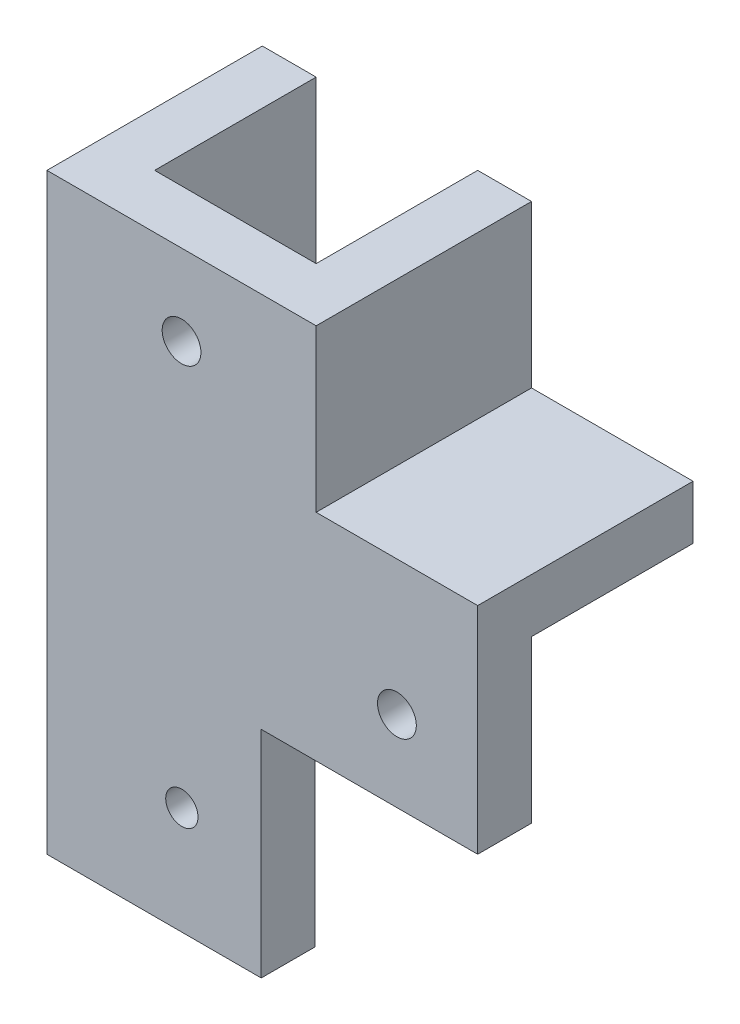
ISO-10303-21;
HEADER;
FILE_DESCRIPTION(('STEP AP214'),'2;1');
FILE_NAME('part.step','',(''),(''),'','','');
FILE_SCHEMA(('AUTOMOTIVE_DESIGN { 1 0 10303 214 1 1 1 1 }'));
ENDSEC;
DATA;
#1=APPLICATION_CONTEXT('core data for automotive mechanical design processes');
#2=APPLICATION_PROTOCOL_DEFINITION('international standard','automotive_design',2000,#1);
#3=PRODUCT_CONTEXT('',#1,'mechanical');
#4=PRODUCT('Part','Part','',(#3));
#5=PRODUCT_RELATED_PRODUCT_CATEGORY('part','',(#4));
#6=PRODUCT_DEFINITION_FORMATION('','',#4);
#7=PRODUCT_DEFINITION_CONTEXT('part definition',#1,'design');
#8=PRODUCT_DEFINITION('design','',#6,#7);
#9=PRODUCT_DEFINITION_SHAPE('','',#8);
#10=(LENGTH_UNIT() NAMED_UNIT(*) SI_UNIT(.MILLI.,.METRE.));
#11=(NAMED_UNIT(*) PLANE_ANGLE_UNIT() SI_UNIT($,.RADIAN.));
#12=(NAMED_UNIT(*) SI_UNIT($,.STERADIAN.) SOLID_ANGLE_UNIT());
#13=UNCERTAINTY_MEASURE_WITH_UNIT(LENGTH_MEASURE(1.E-05),#10,'distance_accuracy_value','');
#14=(GEOMETRIC_REPRESENTATION_CONTEXT(3) GLOBAL_UNCERTAINTY_ASSIGNED_CONTEXT((#13)) GLOBAL_UNIT_ASSIGNED_CONTEXT((#10,
#11,#12)) REPRESENTATION_CONTEXT('',''));
#15=CARTESIAN_POINT('',(0.,0.,0.));
#16=DIRECTION('',(0.,0.,1.));
#17=DIRECTION('',(1.,0.,0.));
#18=AXIS2_PLACEMENT_3D('',#15,#16,#17);
#19=CARTESIAN_POINT('',(7.47011952191236,-10.8067729083665,-15.));
#20=DIRECTION('',(1.,0.,0.));
#21=DIRECTION('',(0.,1.,0.));
#22=AXIS2_PLACEMENT_3D('',#19,#20,#21);
#23=PLANE('',#22);
#24=DIRECTION('',(0.,1.,0.));
#25=VECTOR('',#24,1.);
#26=CARTESIAN_POINT('',(7.47011952191236,9.19322709163348,0.));
#27=LINE('',#26,#25);
#28=CARTESIAN_POINT('',(7.47011952191236,-10.8067729083665,0.));
#29=VERTEX_POINT('',#28);
#30=CARTESIAN_POINT('',(7.47011952191236,9.19322709163348,0.));
#31=VERTEX_POINT('',#30);
#32=EDGE_CURVE('E208',#29,#31,#27,.T.);
#33=ORIENTED_EDGE('',*,*,#32,.T.);
#34=DIRECTION('',(0.,0.,1.));
#35=VECTOR('',#34,1.);
#36=CARTESIAN_POINT('',(7.47011952191236,9.19322709163348,-15.));
#37=LINE('',#36,#35);
#38=CARTESIAN_POINT('',(7.47011952191236,9.19322709163348,-15.));
#39=VERTEX_POINT('',#38);
#40=EDGE_CURVE('E11',#39,#31,#37,.T.);
#41=ORIENTED_EDGE('',*,*,#40,.F.);
#42=DIRECTION('',(0.,1.,0.));
#43=VECTOR('',#42,1.);
#44=CARTESIAN_POINT('',(7.47011952191236,-10.8067729083665,-15.));
#45=LINE('',#44,#43);
#46=CARTESIAN_POINT('',(7.47011952191236,-10.8067729083665,-15.));
#47=VERTEX_POINT('',#46);
#48=EDGE_CURVE('E268',#47,#39,#45,.T.);
#49=ORIENTED_EDGE('',*,*,#48,.F.);
#50=DIRECTION('',(0.,0.,1.));
#51=VECTOR('',#50,1.);
#52=CARTESIAN_POINT('',(7.47011952191236,-10.8067729083665,-15.));
#53=LINE('',#52,#51);
#54=EDGE_CURVE('E284',#47,#29,#53,.T.);
#55=ORIENTED_EDGE('',*,*,#54,.T.);
#56=EDGE_LOOP('',(#33,#41,#49,#55));
#57=FACE_BOUND('',#56,.T.);
#58=ADVANCED_FACE('F41',(#57),#23,.F.);
#59=CARTESIAN_POINT('',(27.4701195219124,-10.8067729083665,-15.));
#60=DIRECTION('',(0.,1.,0.));
#61=DIRECTION('',(-1.,0.,0.));
#62=AXIS2_PLACEMENT_3D('',#59,#60,#61);
#63=PLANE('',#62);
#64=DIRECTION('',(-1.,0.,0.));
#65=VECTOR('',#64,1.);
#66=CARTESIAN_POINT('',(27.4701195219124,-10.8067729083665,0.));
#67=LINE('',#66,#65);
#68=CARTESIAN_POINT('',(27.4701195219124,-10.8067729083665,0.));
#69=VERTEX_POINT('',#68);
#70=EDGE_CURVE('E204',#69,#29,#67,.T.);
#71=ORIENTED_EDGE('',*,*,#70,.T.);
#72=ORIENTED_EDGE('',*,*,#54,.F.);
#73=DIRECTION('',(-1.,0.,0.));
#74=VECTOR('',#73,1.);
#75=CARTESIAN_POINT('',(27.4701195219124,-10.8067729083665,-15.));
#76=LINE('',#75,#74);
#77=CARTESIAN_POINT('',(27.4701195219124,-10.8067729083665,-15.));
#78=VERTEX_POINT('',#77);
#79=EDGE_CURVE('E56',#78,#47,#76,.T.);
#80=ORIENTED_EDGE('',*,*,#79,.F.);
#81=DIRECTION('',(0.,0.,1.));
#82=VECTOR('',#81,1.);
#83=CARTESIAN_POINT('',(27.4701195219124,-10.8067729083665,-15.));
#84=LINE('',#83,#82);
#85=EDGE_CURVE('E288',#78,#69,#84,.T.);
#86=ORIENTED_EDGE('',*,*,#85,.T.);
#87=EDGE_LOOP('',(#71,#72,#80,#86));
#88=FACE_BOUND('',#87,.T.);
#89=ADVANCED_FACE('F342',(#88),#63,.F.);
#90=CARTESIAN_POINT('',(7.47011952191236,9.19322709163348,-15.));
#91=DIRECTION('',(0.,-1.,0.));
#92=DIRECTION('',(0.,0.,-1.));
#93=AXIS2_PLACEMENT_3D('',#90,#91,#92);
#94=PLANE('',#93);
#95=ORIENTED_EDGE('',*,*,#40,.T.);
#96=DIRECTION('',(-1.,0.,0.));
#97=VECTOR('',#96,1.);
#98=CARTESIAN_POINT('',(-7.52988047808764,9.19322709163348,0.));
#99=LINE('',#98,#97);
#100=CARTESIAN_POINT('',(-7.52988047808764,9.19322709163348,0.));
#101=VERTEX_POINT('',#100);
#102=EDGE_CURVE('E196',#31,#101,#99,.T.);
#103=ORIENTED_EDGE('',*,*,#102,.T.);
#104=DIRECTION('',(0.,0.,1.));
#105=VECTOR('',#104,1.);
#106=CARTESIAN_POINT('',(-7.52988047808764,9.19322709163348,-15.));
#107=LINE('',#106,#105);
#108=CARTESIAN_POINT('',(-7.52988047808764,9.19322709163348,-15.));
#109=VERTEX_POINT('',#108);
#110=EDGE_CURVE('E240',#109,#101,#107,.T.);
#111=ORIENTED_EDGE('',*,*,#110,.F.);
#112=DIRECTION('',(1.,0.,0.));
#113=VECTOR('',#112,1.);
#114=CARTESIAN_POINT('',(-7.52988047808764,9.19322709163348,-15.));
#115=LINE('',#114,#113);
#116=CARTESIAN_POINT('',(-12.5298804780876,9.19322709163348,-15.));
#117=VERTEX_POINT('',#116);
#118=EDGE_CURVE('E237',#117,#109,#115,.T.);
#119=ORIENTED_EDGE('',*,*,#118,.F.);
#120=DIRECTION('',(0.,0.,1.));
#121=VECTOR('',#120,1.);
#122=CARTESIAN_POINT('',(-12.5298804780876,9.19322709163348,-15.));
#123=LINE('',#122,#121);
#124=CARTESIAN_POINT('',(-12.5298804780876,9.19322709163348,5.));
#125=VERTEX_POINT('',#124);
#126=EDGE_CURVE('E244',#117,#125,#123,.T.);
#127=ORIENTED_EDGE('',*,*,#126,.T.);
#128=DIRECTION('',(-1.,0.,0.));
#129=VECTOR('',#128,1.);
#130=CARTESIAN_POINT('',(7.47011952191236,9.19322709163348,5.));
#131=LINE('',#130,#129);
#132=CARTESIAN_POINT('',(12.4701195219124,9.19322709163348,5.));
#133=VERTEX_POINT('',#132);
#134=EDGE_CURVE('E265',#133,#125,#131,.T.);
#135=ORIENTED_EDGE('',*,*,#134,.F.);
#136=DIRECTION('',(0.,0.,1.));
#137=VECTOR('',#136,1.);
#138=CARTESIAN_POINT('',(12.4701195219124,9.19322709163348,-15.));
#139=LINE('',#138,#137);
#140=CARTESIAN_POINT('',(12.4701195219124,9.19322709163348,-15.));
#141=VERTEX_POINT('',#140);
#142=EDGE_CURVE('E49',#141,#133,#139,.T.);
#143=ORIENTED_EDGE('',*,*,#142,.F.);
#144=DIRECTION('',(1.,0.,0.));
#145=VECTOR('',#144,1.);
#146=CARTESIAN_POINT('',(7.47011952191236,9.19322709163348,-15.));
#147=LINE('',#146,#145);
#148=EDGE_CURVE('E271',#39,#141,#147,.T.);
#149=ORIENTED_EDGE('',*,*,#148,.F.);
#150=EDGE_LOOP('',(#95,#103,#111,#119,#127,#135,#143,#149));
#151=FACE_BOUND('',#150,.T.);
#152=ADVANCED_FACE('F310',(#151),#94,.F.);
#153=CARTESIAN_POINT('',(12.4701195219124,9.19322709163348,-15.));
#154=DIRECTION('',(-1.,0.,0.));
#155=DIRECTION('',(0.,-1.,0.));
#156=AXIS2_PLACEMENT_3D('',#153,#154,#155);
#157=PLANE('',#156);
#158=ORIENTED_EDGE('',*,*,#142,.T.);
#159=DIRECTION('',(0.,1.,0.));
#160=VECTOR('',#159,1.);
#161=CARTESIAN_POINT('',(12.4701195219124,9.19322709163348,5.));
#162=LINE('',#161,#160);
#163=CARTESIAN_POINT('',(12.4701195219124,-5.80677290836653,5.));
#164=VERTEX_POINT('',#163);
#165=EDGE_CURVE('E261',#164,#133,#162,.T.);
#166=ORIENTED_EDGE('',*,*,#165,.F.);
#167=DIRECTION('',(0.,0.,1.));
#168=VECTOR('',#167,1.);
#169=CARTESIAN_POINT('',(12.4701195219124,-5.80677290836653,-15.));
#170=LINE('',#169,#168);
#171=CARTESIAN_POINT('',(12.4701195219124,-5.80677290836653,-15.));
#172=VERTEX_POINT('',#171);
#173=EDGE_CURVE('E295',#172,#164,#170,.T.);
#174=ORIENTED_EDGE('',*,*,#173,.F.);
#175=DIRECTION('',(0.,-1.,0.));
#176=VECTOR('',#175,1.);
#177=CARTESIAN_POINT('',(12.4701195219124,9.19322709163348,-15.));
#178=LINE('',#177,#176);
#179=EDGE_CURVE('E274',#141,#172,#178,.T.);
#180=ORIENTED_EDGE('',*,*,#179,.F.);
#181=EDGE_LOOP('',(#158,#166,#174,#180));
#182=FACE_BOUND('',#181,.T.);
#183=ADVANCED_FACE('F302',(#182),#157,.F.);
#184=CARTESIAN_POINT('',(12.4701195219124,-5.80677290836653,-15.));
#185=DIRECTION('',(0.,-1.,0.));
#186=DIRECTION('',(1.,0.,0.));
#187=AXIS2_PLACEMENT_3D('',#184,#185,#186);
#188=PLANE('',#187);
#189=ORIENTED_EDGE('',*,*,#173,.T.);
#190=DIRECTION('',(-1.,0.,0.));
#191=VECTOR('',#190,1.);
#192=CARTESIAN_POINT('',(12.4701195219124,-5.80677290836653,5.));
#193=LINE('',#192,#191);
#194=CARTESIAN_POINT('',(27.4701195219124,-5.80677290836653,5.));
#195=VERTEX_POINT('',#194);
#196=EDGE_CURVE('E257',#195,#164,#193,.T.);
#197=ORIENTED_EDGE('',*,*,#196,.F.);
#198=DIRECTION('',(0.,0.,1.));
#199=VECTOR('',#198,1.);
#200=CARTESIAN_POINT('',(27.4701195219124,-5.80677290836653,-15.));
#201=LINE('',#200,#199);
#202=CARTESIAN_POINT('',(27.4701195219124,-5.80677290836653,-15.));
#203=VERTEX_POINT('',#202);
#204=EDGE_CURVE('E292',#203,#195,#201,.T.);
#205=ORIENTED_EDGE('',*,*,#204,.F.);
#206=DIRECTION('',(1.,0.,0.));
#207=VECTOR('',#206,1.);
#208=CARTESIAN_POINT('',(12.4701195219124,-5.80677290836653,-15.));
#209=LINE('',#208,#207);
#210=EDGE_CURVE('E277',#172,#203,#209,.T.);
#211=ORIENTED_EDGE('',*,*,#210,.F.);
#212=EDGE_LOOP('',(#189,#197,#205,#211));
#213=FACE_BOUND('',#212,.T.);
#214=ADVANCED_FACE('F337',(#213),#188,.F.);
#215=CARTESIAN_POINT('',(27.4701195219124,-10.8067729083665,-15.));
#216=DIRECTION('',(-1.,0.,0.));
#217=DIRECTION('',(0.,0.,1.));
#218=AXIS2_PLACEMENT_3D('',#215,#216,#217);
#219=PLANE('',#218);
#220=ORIENTED_EDGE('',*,*,#204,.T.);
#221=DIRECTION('',(0.,1.,0.));
#222=VECTOR('',#221,1.);
#223=CARTESIAN_POINT('',(27.4701195219124,-5.80677290836653,5.));
#224=LINE('',#223,#222);
#225=CARTESIAN_POINT('',(27.4701195219124,-25.8067729083665,5.));
#226=VERTEX_POINT('',#225);
#227=EDGE_CURVE('E253',#226,#195,#224,.T.);
#228=ORIENTED_EDGE('',*,*,#227,.F.);
#229=DIRECTION('',(0.,0.,-1.));
#230=VECTOR('',#229,1.);
#231=CARTESIAN_POINT('',(27.4701195219124,-25.8067729083665,5.));
#232=LINE('',#231,#230);
#233=CARTESIAN_POINT('',(27.4701195219124,-25.8067729083665,0.));
#234=VERTEX_POINT('',#233);
#235=EDGE_CURVE('E195',#226,#234,#232,.T.);
#236=ORIENTED_EDGE('',*,*,#235,.T.);
#237=DIRECTION('',(0.,1.,0.));
#238=VECTOR('',#237,1.);
#239=CARTESIAN_POINT('',(27.4701195219124,-25.8067729083665,0.));
#240=LINE('',#239,#238);
#241=EDGE_CURVE('E201',#234,#69,#240,.T.);
#242=ORIENTED_EDGE('',*,*,#241,.T.);
#243=ORIENTED_EDGE('',*,*,#85,.F.);
#244=DIRECTION('',(0.,-1.,0.));
#245=VECTOR('',#244,1.);
#246=CARTESIAN_POINT('',(27.4701195219124,-10.8067729083665,-15.));
#247=LINE('',#246,#245);
#248=EDGE_CURVE('E61',#203,#78,#247,.T.);
#249=ORIENTED_EDGE('',*,*,#248,.F.);
#250=EDGE_LOOP('',(#220,#228,#236,#242,#243,#249));
#251=FACE_BOUND('',#250,.T.);
#252=ADVANCED_FACE('F330',(#251),#219,.F.);
#253=CARTESIAN_POINT('',(0.,0.,-15.));
#254=DIRECTION('',(0.,0.,-1.));
#255=DIRECTION('',(-1.,0.,0.));
#256=AXIS2_PLACEMENT_3D('',#253,#254,#255);
#257=PLANE('',#256);
#258=ORIENTED_EDGE('',*,*,#48,.T.);
#259=ORIENTED_EDGE('',*,*,#148,.T.);
#260=ORIENTED_EDGE('',*,*,#179,.T.);
#261=ORIENTED_EDGE('',*,*,#210,.T.);
#262=ORIENTED_EDGE('',*,*,#248,.T.);
#263=ORIENTED_EDGE('',*,*,#79,.T.);
#264=EDGE_LOOP('',(#258,#259,#260,#261,#262,#263));
#265=FACE_BOUND('',#264,.T.);
#266=ADVANCED_FACE('F328',(#265),#257,.T.);
#267=CARTESIAN_POINT('',(0.,0.,5.));
#268=DIRECTION('',(0.,0.,-1.));
#269=DIRECTION('',(-1.,0.,0.));
#270=AXIS2_PLACEMENT_3D('',#267,#268,#269);
#271=PLANE('',#270);
#272=DIRECTION('',(1.,0.,0.));
#273=VECTOR('',#272,1.);
#274=CARTESIAN_POINT('',(-7.52988047808764,-25.8067729083665,5.));
#275=LINE('',#274,#273);
#276=CARTESIAN_POINT('',(7.37011952191236,-25.8067729083665,5.));
#277=VERTEX_POINT('',#276);
#278=EDGE_CURVE('E191',#277,#226,#275,.T.);
#279=ORIENTED_EDGE('',*,*,#278,.T.);
#280=ORIENTED_EDGE('',*,*,#227,.T.);
#281=ORIENTED_EDGE('',*,*,#196,.T.);
#282=ORIENTED_EDGE('',*,*,#165,.T.);
#283=ORIENTED_EDGE('',*,*,#134,.T.);
#284=DIRECTION('',(0.,-1.,0.));
#285=VECTOR('',#284,1.);
#286=CARTESIAN_POINT('',(-12.5298804780876,9.19322709163348,5.));
#287=LINE('',#286,#285);
#288=CARTESIAN_POINT('',(-12.5298804780876,-45.8067729083665,5.));
#289=VERTEX_POINT('',#288);
#290=EDGE_CURVE('E217',#125,#289,#287,.T.);
#291=ORIENTED_EDGE('',*,*,#290,.T.);
#292=DIRECTION('',(1.,0.,0.));
#293=VECTOR('',#292,1.);
#294=CARTESIAN_POINT('',(-12.5298804780876,-45.8067729083665,5.));
#295=LINE('',#294,#293);
#296=CARTESIAN_POINT('',(7.37011952191236,-45.8067729083665,5.));
#297=VERTEX_POINT('',#296);
#298=EDGE_CURVE('E225',#289,#297,#295,.T.);
#299=ORIENTED_EDGE('',*,*,#298,.T.);
#300=DIRECTION('',(0.,1.,0.));
#301=VECTOR('',#300,1.);
#302=CARTESIAN_POINT('',(7.37011952191236,-45.8067729083665,5.));
#303=LINE('',#302,#301);
#304=EDGE_CURVE('E144',#297,#277,#303,.T.);
#305=ORIENTED_EDGE('',*,*,#304,.T.);
#306=EDGE_LOOP('',(#279,#280,#281,#282,#283,#291,#299,#305));
#307=FACE_BOUND('',#306,.T.);
#308=CARTESIAN_POINT('',(0.,-35.8067729083665,5.));
#309=DIRECTION('',(0.,0.,1.));
#310=DIRECTION('',(1.,0.,0.));
#311=AXIS2_PLACEMENT_3D('',#308,#309,#310);
#312=CIRCLE('',#311,1.5);
#313=CARTESIAN_POINT('',(1.5,-35.8067729083665,5.));
#314=VERTEX_POINT('',#313);
#315=EDGE_CURVE('E221',#314,#314,#312,.T.);
#316=ORIENTED_EDGE('',*,*,#315,.F.);
#317=EDGE_LOOP('',(#316));
#318=FACE_BOUND('',#317,.T.);
#319=CARTESIAN_POINT('',(-0.0298804780876419,1.69322709163348,5.));
#320=DIRECTION('',(0.,0.,-1.));
#321=DIRECTION('',(-1.,0.,0.));
#322=AXIS2_PLACEMENT_3D('',#319,#320,#321);
#323=CIRCLE('',#322,1.8);
#324=CARTESIAN_POINT('',(-1.82988047808764,1.69322709163348,5.));
#325=VERTEX_POINT('',#324);
#326=EDGE_CURVE('E175',#325,#325,#323,.T.);
#327=ORIENTED_EDGE('',*,*,#326,.T.);
#328=EDGE_LOOP('',(#327));
#329=FACE_BOUND('',#328,.T.);
#330=CARTESIAN_POINT('',(19.9701195219124,-18.3067729083665,5.));
#331=DIRECTION('',(0.,0.,-1.));
#332=DIRECTION('',(-1.,0.,0.));
#333=AXIS2_PLACEMENT_3D('',#330,#331,#332);
#334=CIRCLE('',#333,1.8);
#335=CARTESIAN_POINT('',(18.1701195219124,-18.3067729083665,5.));
#336=VERTEX_POINT('',#335);
#337=EDGE_CURVE('E184',#336,#336,#334,.T.);
#338=ORIENTED_EDGE('',*,*,#337,.T.);
#339=EDGE_LOOP('',(#338));
#340=FACE_BOUND('',#339,.T.);
#341=ADVANCED_FACE('F307',(#307,#318,#329,#340),#271,.F.);
#342=CARTESIAN_POINT('',(-7.52988047808764,-25.8067729083665,-15.));
#343=DIRECTION('',(-1.,0.,0.));
#344=DIRECTION('',(0.,-1.,0.));
#345=AXIS2_PLACEMENT_3D('',#342,#343,#344);
#346=PLANE('',#345);
#347=ORIENTED_EDGE('',*,*,#110,.T.);
#348=DIRECTION('',(0.,-1.,0.));
#349=VECTOR('',#348,1.);
#350=CARTESIAN_POINT('',(-7.52988047808764,9.19322709163348,0.));
#351=LINE('',#350,#349);
#352=CARTESIAN_POINT('',(-7.52988047808765,-45.8067729083665,0.));
#353=VERTEX_POINT('',#352);
#354=EDGE_CURVE('E179',#101,#353,#351,.T.);
#355=ORIENTED_EDGE('',*,*,#354,.T.);
#356=DIRECTION('',(0.,0.,1.));
#357=VECTOR('',#356,1.);
#358=CARTESIAN_POINT('',(-7.52988047808765,-45.8067729083665,-15.));
#359=LINE('',#358,#357);
#360=CARTESIAN_POINT('',(-7.52988047808765,-45.8067729083665,-15.));
#361=VERTEX_POINT('',#360);
#362=EDGE_CURVE('E155',#361,#353,#359,.T.);
#363=ORIENTED_EDGE('',*,*,#362,.F.);
#364=DIRECTION('',(0.,-1.,0.));
#365=VECTOR('',#364,1.);
#366=CARTESIAN_POINT('',(-7.52988047808764,-25.8067729083665,-15.));
#367=LINE('',#366,#365);
#368=EDGE_CURVE('E228',#109,#361,#367,.T.);
#369=ORIENTED_EDGE('',*,*,#368,.F.);
#370=EDGE_LOOP('',(#347,#355,#363,#369));
#371=FACE_BOUND('',#370,.T.);
#372=ADVANCED_FACE('F323',(#371),#346,.F.);
#373=CARTESIAN_POINT('',(-7.52988047808765,-45.8067729083665,-15.));
#374=DIRECTION('',(0.,1.,0.));
#375=DIRECTION('',(0.,0.,1.));
#376=AXIS2_PLACEMENT_3D('',#373,#374,#375);
#377=PLANE('',#376);
#378=ORIENTED_EDGE('',*,*,#362,.T.);
#379=DIRECTION('',(1.,0.,0.));
#380=VECTOR('',#379,1.);
#381=CARTESIAN_POINT('',(-7.52988047808764,-45.8067729083665,0.));
#382=LINE('',#381,#380);
#383=CARTESIAN_POINT('',(7.37011952191236,-45.8067729083665,0.));
#384=VERTEX_POINT('',#383);
#385=EDGE_CURVE('E151',#353,#384,#382,.T.);
#386=ORIENTED_EDGE('',*,*,#385,.T.);
#387=DIRECTION('',(0.,0.,1.));
#388=VECTOR('',#387,1.);
#389=CARTESIAN_POINT('',(7.37011952191236,-45.8067729083665,0.));
#390=LINE('',#389,#388);
#391=EDGE_CURVE('E137',#384,#297,#390,.T.);
#392=ORIENTED_EDGE('',*,*,#391,.T.);
#393=ORIENTED_EDGE('',*,*,#298,.F.);
#394=DIRECTION('',(0.,0.,1.));
#395=VECTOR('',#394,1.);
#396=CARTESIAN_POINT('',(-12.5298804780876,-45.8067729083665,-15.));
#397=LINE('',#396,#395);
#398=CARTESIAN_POINT('',(-12.5298804780876,-45.8067729083665,-15.));
#399=VERTEX_POINT('',#398);
#400=EDGE_CURVE('E248',#399,#289,#397,.T.);
#401=ORIENTED_EDGE('',*,*,#400,.F.);
#402=DIRECTION('',(-1.,0.,0.));
#403=VECTOR('',#402,1.);
#404=CARTESIAN_POINT('',(-7.52988047808765,-45.8067729083665,-15.));
#405=LINE('',#404,#403);
#406=EDGE_CURVE('E231',#361,#399,#405,.T.);
#407=ORIENTED_EDGE('',*,*,#406,.F.);
#408=EDGE_LOOP('',(#378,#386,#392,#393,#401,#407));
#409=FACE_BOUND('',#408,.T.);
#410=ADVANCED_FACE('F152',(#409),#377,.F.);
#411=CARTESIAN_POINT('',(-12.5298804780876,-45.8067729083665,-15.));
#412=DIRECTION('',(1.,0.,0.));
#413=DIRECTION('',(0.,0.,-1.));
#414=AXIS2_PLACEMENT_3D('',#411,#412,#413);
#415=PLANE('',#414);
#416=ORIENTED_EDGE('',*,*,#400,.T.);
#417=ORIENTED_EDGE('',*,*,#290,.F.);
#418=ORIENTED_EDGE('',*,*,#126,.F.);
#419=DIRECTION('',(0.,1.,0.));
#420=VECTOR('',#419,1.);
#421=CARTESIAN_POINT('',(-12.5298804780876,-45.8067729083665,-15.));
#422=LINE('',#421,#420);
#423=EDGE_CURVE('E234',#399,#117,#422,.T.);
#424=ORIENTED_EDGE('',*,*,#423,.F.);
#425=EDGE_LOOP('',(#416,#417,#418,#424));
#426=FACE_BOUND('',#425,.T.);
#427=ADVANCED_FACE('F317',(#426),#415,.F.);
#428=CARTESIAN_POINT('',(0.,0.,-15.));
#429=DIRECTION('',(0.,0.,1.));
#430=DIRECTION('',(1.,0.,0.));
#431=AXIS2_PLACEMENT_3D('',#428,#429,#430);
#432=PLANE('',#431);
#433=ORIENTED_EDGE('',*,*,#368,.T.);
#434=ORIENTED_EDGE('',*,*,#406,.T.);
#435=ORIENTED_EDGE('',*,*,#423,.T.);
#436=ORIENTED_EDGE('',*,*,#118,.T.);
#437=EDGE_LOOP('',(#433,#434,#435,#436));
#438=FACE_BOUND('',#437,.T.);
#439=ADVANCED_FACE('F320',(#438),#432,.F.);
#440=CARTESIAN_POINT('',(7.37011952191236,-25.8067729083665,5.));
#441=DIRECTION('',(0.,1.,0.));
#442=DIRECTION('',(0.,0.,1.));
#443=AXIS2_PLACEMENT_3D('',#440,#441,#442);
#444=PLANE('',#443);
#445=DIRECTION('',(0.,0.,1.));
#446=VECTOR('',#445,1.);
#447=CARTESIAN_POINT('',(7.37011952191236,-25.8067729083665,0.));
#448=LINE('',#447,#446);
#449=CARTESIAN_POINT('',(7.37011952191236,-25.8067729083665,0.));
#450=VERTEX_POINT('',#449);
#451=EDGE_CURVE('E148',#450,#277,#448,.T.);
#452=ORIENTED_EDGE('',*,*,#451,.F.);
#453=DIRECTION('',(1.,0.,0.));
#454=VECTOR('',#453,1.);
#455=CARTESIAN_POINT('',(7.37011952191236,-25.8067729083665,0.));
#456=LINE('',#455,#454);
#457=EDGE_CURVE('E164',#450,#234,#456,.T.);
#458=ORIENTED_EDGE('',*,*,#457,.T.);
#459=ORIENTED_EDGE('',*,*,#235,.F.);
#460=ORIENTED_EDGE('',*,*,#278,.F.);
#461=EDGE_LOOP('',(#452,#458,#459,#460));
#462=FACE_BOUND('',#461,.T.);
#463=ADVANCED_FACE('F414',(#462),#444,.F.);
#464=CARTESIAN_POINT('',(0.,0.,0.));
#465=DIRECTION('',(0.,0.,1.));
#466=DIRECTION('',(1.,0.,0.));
#467=AXIS2_PLACEMENT_3D('',#464,#465,#466);
#468=PLANE('',#467);
#469=CARTESIAN_POINT('',(0.,-35.8067729083665,0.));
#470=DIRECTION('',(0.,0.,1.));
#471=DIRECTION('',(1.,0.,0.));
#472=AXIS2_PLACEMENT_3D('',#469,#470,#471);
#473=CIRCLE('',#472,1.5);
#474=CARTESIAN_POINT('',(1.5,-35.8067729083665,0.));
#475=VERTEX_POINT('',#474);
#476=EDGE_CURVE('E171',#475,#475,#473,.T.);
#477=ORIENTED_EDGE('',*,*,#476,.T.);
#478=EDGE_LOOP('',(#477));
#479=FACE_BOUND('',#478,.T.);
#480=CARTESIAN_POINT('',(-0.0298804780876419,1.69322709163348,0.));
#481=DIRECTION('',(0.,0.,-1.));
#482=DIRECTION('',(-1.,0.,0.));
#483=AXIS2_PLACEMENT_3D('',#480,#481,#482);
#484=CIRCLE('',#483,1.8);
#485=CARTESIAN_POINT('',(-1.82988047808764,1.69322709163348,0.));
#486=VERTEX_POINT('',#485);
#487=EDGE_CURVE('E180',#486,#486,#484,.T.);
#488=ORIENTED_EDGE('',*,*,#487,.F.);
#489=EDGE_LOOP('',(#488));
#490=FACE_BOUND('',#489,.T.);
#491=CARTESIAN_POINT('',(19.9701195219124,-18.3067729083665,0.));
#492=DIRECTION('',(0.,0.,-1.));
#493=DIRECTION('',(-1.,0.,0.));
#494=AXIS2_PLACEMENT_3D('',#491,#492,#493);
#495=CIRCLE('',#494,1.8);
#496=CARTESIAN_POINT('',(18.1701195219124,-18.3067729083665,0.));
#497=VERTEX_POINT('',#496);
#498=EDGE_CURVE('E173',#497,#497,#495,.T.);
#499=ORIENTED_EDGE('',*,*,#498,.F.);
#500=EDGE_LOOP('',(#499));
#501=FACE_BOUND('',#500,.T.);
#502=ORIENTED_EDGE('',*,*,#354,.F.);
#503=ORIENTED_EDGE('',*,*,#102,.F.);
#504=ORIENTED_EDGE('',*,*,#32,.F.);
#505=ORIENTED_EDGE('',*,*,#70,.F.);
#506=ORIENTED_EDGE('',*,*,#241,.F.);
#507=ORIENTED_EDGE('',*,*,#457,.F.);
#508=DIRECTION('',(0.,1.,0.));
#509=VECTOR('',#508,1.);
#510=CARTESIAN_POINT('',(7.37011952191236,-45.8067729083665,0.));
#511=LINE('',#510,#509);
#512=EDGE_CURVE('E142',#384,#450,#511,.T.);
#513=ORIENTED_EDGE('',*,*,#512,.F.);
#514=ORIENTED_EDGE('',*,*,#385,.F.);
#515=EDGE_LOOP('',(#502,#503,#504,#505,#506,#507,#513,#514));
#516=FACE_BOUND('',#515,.T.);
#517=ADVANCED_FACE('F162',(#479,#490,#501,#516),#468,.F.);
#518=CARTESIAN_POINT('',(19.9701195219124,-18.3067729083665,5.));
#519=DIRECTION('',(0.,0.,-1.));
#520=DIRECTION('',(-1.,0.,0.));
#521=AXIS2_PLACEMENT_3D('',#518,#519,#520);
#522=CYLINDRICAL_SURFACE('',#521,1.8);
#523=ORIENTED_EDGE('',*,*,#337,.F.);
#524=EDGE_LOOP('',(#523));
#525=FACE_BOUND('',#524,.T.);
#526=ORIENTED_EDGE('',*,*,#498,.T.);
#527=EDGE_LOOP('',(#526));
#528=FACE_BOUND('',#527,.T.);
#529=ADVANCED_FACE('F433',(#525,#528),#522,.F.);
#530=CARTESIAN_POINT('',(-0.0298804780876419,1.69322709163348,5.));
#531=DIRECTION('',(0.,0.,-1.));
#532=DIRECTION('',(-1.,0.,0.));
#533=AXIS2_PLACEMENT_3D('',#530,#531,#532);
#534=CYLINDRICAL_SURFACE('',#533,1.8);
#535=ORIENTED_EDGE('',*,*,#326,.F.);
#536=EDGE_LOOP('',(#535));
#537=FACE_BOUND('',#536,.T.);
#538=ORIENTED_EDGE('',*,*,#487,.T.);
#539=EDGE_LOOP('',(#538));
#540=FACE_BOUND('',#539,.T.);
#541=ADVANCED_FACE('F444',(#537,#540),#534,.F.);
#542=CARTESIAN_POINT('',(7.37011952191236,-45.8067729083665,0.));
#543=DIRECTION('',(1.,0.,0.));
#544=DIRECTION('',(0.,1.,0.));
#545=AXIS2_PLACEMENT_3D('',#542,#543,#544);
#546=PLANE('',#545);
#547=ORIENTED_EDGE('',*,*,#304,.F.);
#548=ORIENTED_EDGE('',*,*,#391,.F.);
#549=ORIENTED_EDGE('',*,*,#512,.T.);
#550=ORIENTED_EDGE('',*,*,#451,.T.);
#551=EDGE_LOOP('',(#547,#548,#549,#550));
#552=FACE_BOUND('',#551,.T.);
#553=ADVANCED_FACE('F139',(#552),#546,.T.);
#554=CARTESIAN_POINT('',(0.,-35.8067729083665,-15.));
#555=DIRECTION('',(0.,0.,1.));
#556=DIRECTION('',(1.,0.,0.));
#557=AXIS2_PLACEMENT_3D('',#554,#555,#556);
#558=CYLINDRICAL_SURFACE('',#557,1.5);
#559=ORIENTED_EDGE('',*,*,#315,.T.);
#560=EDGE_LOOP('',(#559));
#561=FACE_BOUND('',#560,.T.);
#562=ORIENTED_EDGE('',*,*,#476,.F.);
#563=EDGE_LOOP('',(#562));
#564=FACE_BOUND('',#563,.T.);
#565=ADVANCED_FACE('F463',(#561,#564),#558,.F.);
#566=CLOSED_SHELL('',(#58,#89,#152,#183,#214,#252,#266,#341,#372,#410,#427,#439,#463,#517,#529,
#541,#553,#565));
#567=MANIFOLD_SOLID_BREP('B2',#566);
#568=ADVANCED_BREP_SHAPE_REPRESENTATION('',(#18,#567),#14);
#569=SHAPE_DEFINITION_REPRESENTATION(#9,#568);
ENDSEC;
END-ISO-10303-21;
